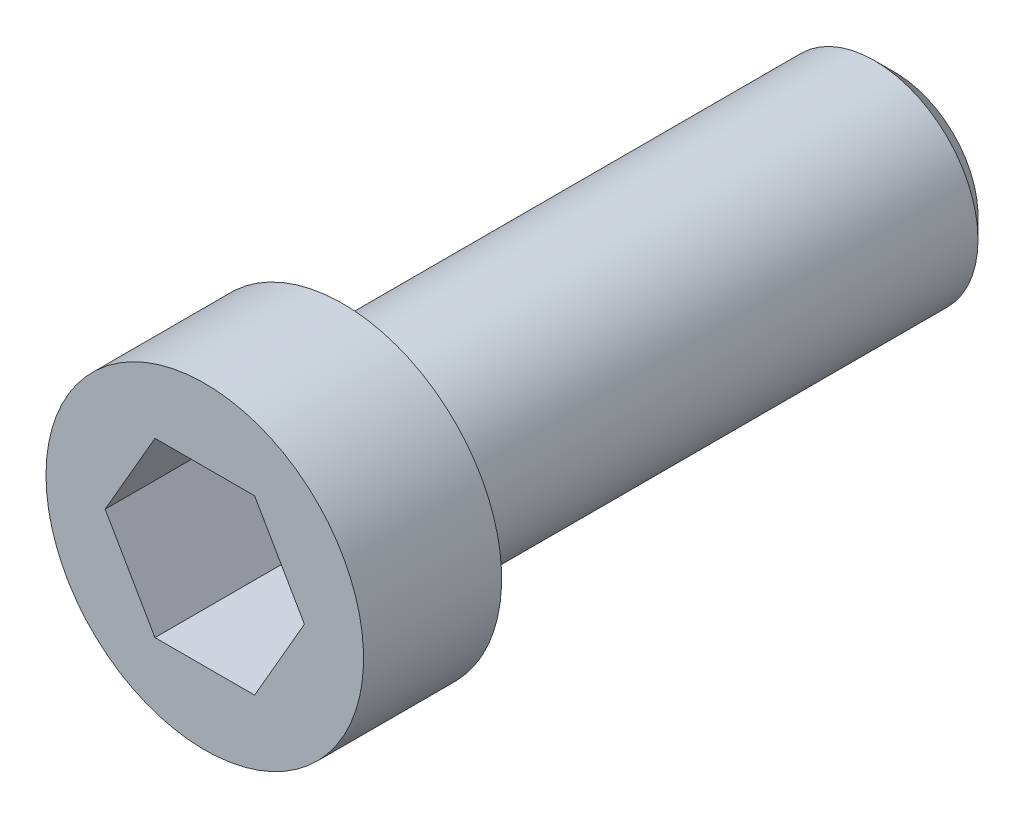
ISO-10303-21;
HEADER;
FILE_DESCRIPTION(('STEP AP214'),'2;1');
FILE_NAME('part.step','',(''),(''),'','','');
FILE_SCHEMA(('AUTOMOTIVE_DESIGN { 1 0 10303 214 1 1 1 1 }'));
ENDSEC;
DATA;
#1=APPLICATION_CONTEXT('core data for automotive mechanical design processes');
#2=APPLICATION_PROTOCOL_DEFINITION('international standard','automotive_design',2000,#1);
#3=PRODUCT_CONTEXT('',#1,'mechanical');
#4=PRODUCT('Part','Part','',(#3));
#5=PRODUCT_RELATED_PRODUCT_CATEGORY('part','',(#4));
#6=PRODUCT_DEFINITION_FORMATION('','',#4);
#7=PRODUCT_DEFINITION_CONTEXT('part definition',#1,'design');
#8=PRODUCT_DEFINITION('design','',#6,#7);
#9=PRODUCT_DEFINITION_SHAPE('','',#8);
#10=(LENGTH_UNIT() NAMED_UNIT(*) SI_UNIT(.MILLI.,.METRE.));
#11=(NAMED_UNIT(*) PLANE_ANGLE_UNIT() SI_UNIT($,.RADIAN.));
#12=(NAMED_UNIT(*) SI_UNIT($,.STERADIAN.) SOLID_ANGLE_UNIT());
#13=UNCERTAINTY_MEASURE_WITH_UNIT(LENGTH_MEASURE(1.E-05),#10,'distance_accuracy_value','');
#14=(GEOMETRIC_REPRESENTATION_CONTEXT(3) GLOBAL_UNCERTAINTY_ASSIGNED_CONTEXT((#13)) GLOBAL_UNIT_ASSIGNED_CONTEXT((#10,
#11,#12)) REPRESENTATION_CONTEXT('',''));
#15=CARTESIAN_POINT('',(0.,0.,0.));
#16=DIRECTION('',(0.,0.,1.));
#17=DIRECTION('',(1.,0.,0.));
#18=AXIS2_PLACEMENT_3D('',#15,#16,#17);
#19=CARTESIAN_POINT('',(0.,0.,0.));
#20=DIRECTION('',(0.,0.,1.));
#21=DIRECTION('',(1.,0.,0.));
#22=AXIS2_PLACEMENT_3D('',#19,#20,#21);
#23=PLANE('',#22);
#24=DIRECTION('',(0.5,0.866025403784439,0.));
#25=VECTOR('',#24,1.);
#26=CARTESIAN_POINT('',(0.721687836487033,-1.25,0.));
#27=LINE('',#26,#25);
#28=CARTESIAN_POINT('',(0.721687836487033,-1.25,0.));
#29=VERTEX_POINT('',#28);
#30=CARTESIAN_POINT('',(1.44337567297407,0.,0.));
#31=VERTEX_POINT('',#30);
#32=EDGE_CURVE('E49',#29,#31,#27,.T.);
#33=ORIENTED_EDGE('',*,*,#32,.F.);
#34=DIRECTION('',(1.,0.,0.));
#35=VECTOR('',#34,1.);
#36=CARTESIAN_POINT('',(-0.721687836487032,-1.25,0.));
#37=LINE('',#36,#35);
#38=CARTESIAN_POINT('',(-0.721687836487032,-1.25,0.));
#39=VERTEX_POINT('',#38);
#40=EDGE_CURVE('E132',#39,#29,#37,.T.);
#41=ORIENTED_EDGE('',*,*,#40,.F.);
#42=DIRECTION('',(0.5,-0.866025403784439,0.));
#43=VECTOR('',#42,1.);
#44=CARTESIAN_POINT('',(-1.44337567297406,0.,0.));
#45=LINE('',#44,#43);
#46=CARTESIAN_POINT('',(-1.44337567297406,0.,0.));
#47=VERTEX_POINT('',#46);
#48=EDGE_CURVE('E130',#47,#39,#45,.T.);
#49=ORIENTED_EDGE('',*,*,#48,.F.);
#50=DIRECTION('',(-0.5,-0.866025403784439,0.));
#51=VECTOR('',#50,1.);
#52=CARTESIAN_POINT('',(-0.721687836487032,1.25,0.));
#53=LINE('',#52,#51);
#54=CARTESIAN_POINT('',(-0.721687836487032,1.25,0.));
#55=VERTEX_POINT('',#54);
#56=EDGE_CURVE('E97',#55,#47,#53,.T.);
#57=ORIENTED_EDGE('',*,*,#56,.F.);
#58=DIRECTION('',(-1.,0.,0.));
#59=VECTOR('',#58,1.);
#60=CARTESIAN_POINT('',(0.721687836487032,1.25,0.));
#61=LINE('',#60,#59);
#62=CARTESIAN_POINT('',(0.721687836487032,1.25,0.));
#63=VERTEX_POINT('',#62);
#64=EDGE_CURVE('E126',#63,#55,#61,.T.);
#65=ORIENTED_EDGE('',*,*,#64,.F.);
#66=DIRECTION('',(-0.5,0.866025403784438,0.));
#67=VECTOR('',#66,1.);
#68=CARTESIAN_POINT('',(1.44337567297407,0.,0.));
#69=LINE('',#68,#67);
#70=EDGE_CURVE('E123',#31,#63,#69,.T.);
#71=ORIENTED_EDGE('',*,*,#70,.F.);
#72=EDGE_LOOP('',(#33,#41,#49,#57,#65,#71));
#73=FACE_BOUND('',#72,.T.);
#74=CARTESIAN_POINT('',(0.,0.,0.));
#75=DIRECTION('',(0.,0.,-1.));
#76=DIRECTION('',(-1.,0.,0.));
#77=AXIS2_PLACEMENT_3D('',#74,#75,#76);
#78=CIRCLE('',#77,2.3);
#79=CARTESIAN_POINT('',(-2.3,0.,0.));
#80=VERTEX_POINT('',#79);
#81=EDGE_CURVE('E144',#80,#80,#78,.T.);
#82=ORIENTED_EDGE('',*,*,#81,.F.);
#83=EDGE_LOOP('',(#82));
#84=FACE_BOUND('',#83,.T.);
#85=ADVANCED_FACE('F34',(#73,#84),#23,.T.);
#86=CARTESIAN_POINT('',(0.,0.,0.));
#87=DIRECTION('',(0.,0.,-1.));
#88=DIRECTION('',(-1.,0.,0.));
#89=AXIS2_PLACEMENT_3D('',#86,#87,#88);
#90=CYLINDRICAL_SURFACE('',#89,2.3);
#91=ORIENTED_EDGE('',*,*,#81,.T.);
#92=EDGE_LOOP('',(#91));
#93=FACE_BOUND('',#92,.T.);
#94=CARTESIAN_POINT('',(0.,0.,-2.));
#95=DIRECTION('',(0.,0.,-1.));
#96=DIRECTION('',(-1.,0.,0.));
#97=AXIS2_PLACEMENT_3D('',#94,#95,#96);
#98=CIRCLE('',#97,2.3);
#99=CARTESIAN_POINT('',(-2.3,0.,-2.));
#100=VERTEX_POINT('',#99);
#101=EDGE_CURVE('E136',#100,#100,#98,.T.);
#102=ORIENTED_EDGE('',*,*,#101,.F.);
#103=EDGE_LOOP('',(#102));
#104=FACE_BOUND('',#103,.T.);
#105=ADVANCED_FACE('F166',(#93,#104),#90,.T.);
#106=CARTESIAN_POINT('',(0.,2.3,-2.));
#107=DIRECTION('',(0.,0.,-1.));
#108=DIRECTION('',(-1.,0.,0.));
#109=AXIS2_PLACEMENT_3D('',#106,#107,#108);
#110=PLANE('',#109);
#111=CARTESIAN_POINT('',(0.,0.,-2.));
#112=DIRECTION('',(0.,0.,-1.));
#113=DIRECTION('',(-1.,0.,0.));
#114=AXIS2_PLACEMENT_3D('',#111,#112,#113);
#115=CIRCLE('',#114,1.8);
#116=CARTESIAN_POINT('',(-1.8,0.,-2.));
#117=VERTEX_POINT('',#116);
#118=EDGE_CURVE('E150',#117,#117,#115,.F.);
#119=ORIENTED_EDGE('',*,*,#118,.T.);
#120=EDGE_LOOP('',(#119));
#121=FACE_BOUND('',#120,.T.);
#122=ORIENTED_EDGE('',*,*,#101,.T.);
#123=EDGE_LOOP('',(#122));
#124=FACE_BOUND('',#123,.T.);
#125=ADVANCED_FACE('F172',(#121,#124),#110,.T.);
#126=CARTESIAN_POINT('',(0.,0.,0.));
#127=DIRECTION('',(0.,0.,-1.));
#128=DIRECTION('',(-1.,0.,0.));
#129=AXIS2_PLACEMENT_3D('',#126,#127,#128);
#130=CYLINDRICAL_SURFACE('',#129,1.5);
#131=CARTESIAN_POINT('',(0.,0.,-9.7));
#132=DIRECTION('',(0.,0.,-1.));
#133=DIRECTION('',(-1.,0.,0.));
#134=AXIS2_PLACEMENT_3D('',#131,#132,#133);
#135=CIRCLE('',#134,1.5);
#136=CARTESIAN_POINT('',(-1.5,0.,-9.7));
#137=VERTEX_POINT('',#136);
#138=EDGE_CURVE('E11',#137,#137,#135,.F.);
#139=ORIENTED_EDGE('',*,*,#138,.T.);
#140=EDGE_LOOP('',(#139));
#141=FACE_BOUND('',#140,.T.);
#142=CARTESIAN_POINT('',(0.,0.,-2.3));
#143=DIRECTION('',(0.,0.,-1.));
#144=DIRECTION('',(-1.,0.,0.));
#145=AXIS2_PLACEMENT_3D('',#142,#143,#144);
#146=CIRCLE('',#145,1.5);
#147=CARTESIAN_POINT('',(-1.5,0.,-2.3));
#148=VERTEX_POINT('',#147);
#149=EDGE_CURVE('E147',#148,#148,#146,.T.);
#150=ORIENTED_EDGE('',*,*,#149,.T.);
#151=EDGE_LOOP('',(#150));
#152=FACE_BOUND('',#151,.T.);
#153=ADVANCED_FACE('F179',(#141,#152),#130,.T.);
#154=CARTESIAN_POINT('',(0.,1.5,-10.));
#155=DIRECTION('',(0.,0.,-1.));
#156=DIRECTION('',(-1.,0.,0.));
#157=AXIS2_PLACEMENT_3D('',#154,#155,#156);
#158=PLANE('',#157);
#159=CARTESIAN_POINT('',(0.,0.,-10.));
#160=DIRECTION('',(0.,0.,-1.));
#161=DIRECTION('',(-1.,0.,0.));
#162=AXIS2_PLACEMENT_3D('',#159,#160,#161);
#163=CIRCLE('',#162,1.2);
#164=CARTESIAN_POINT('',(-1.2,0.,-10.));
#165=VERTEX_POINT('',#164);
#166=EDGE_CURVE('E42',#165,#165,#163,.T.);
#167=ORIENTED_EDGE('',*,*,#166,.T.);
#168=EDGE_LOOP('',(#167));
#169=FACE_BOUND('',#168,.T.);
#170=ADVANCED_FACE('F155',(#169),#158,.T.);
#171=CARTESIAN_POINT('',(0.721687836487033,-1.25,-2.));
#172=DIRECTION('',(0.866025403784439,-0.5,0.));
#173=DIRECTION('',(0.5,0.866025403784439,0.));
#174=AXIS2_PLACEMENT_3D('',#171,#172,#173);
#175=PLANE('',#174);
#176=ORIENTED_EDGE('',*,*,#32,.T.);
#177=DIRECTION('',(0.,0.,1.));
#178=VECTOR('',#177,1.);
#179=CARTESIAN_POINT('',(1.44337567297407,0.,-2.));
#180=LINE('',#179,#178);
#181=CARTESIAN_POINT('',(1.44337567297407,0.,-2.));
#182=VERTEX_POINT('',#181);
#183=EDGE_CURVE('E79',#182,#31,#180,.T.);
#184=ORIENTED_EDGE('',*,*,#183,.F.);
#185=DIRECTION('',(0.5,0.866025403784439,0.));
#186=VECTOR('',#185,1.);
#187=CARTESIAN_POINT('',(0.721687836487033,-1.25,-2.));
#188=LINE('',#187,#186);
#189=CARTESIAN_POINT('',(0.721687836487033,-1.25,-2.));
#190=VERTEX_POINT('',#189);
#191=EDGE_CURVE('E134',#190,#182,#188,.T.);
#192=ORIENTED_EDGE('',*,*,#191,.F.);
#193=DIRECTION('',(0.,0.,1.));
#194=VECTOR('',#193,1.);
#195=CARTESIAN_POINT('',(0.721687836487033,-1.25,-2.));
#196=LINE('',#195,#194);
#197=EDGE_CURVE('E57',#190,#29,#196,.T.);
#198=ORIENTED_EDGE('',*,*,#197,.T.);
#199=EDGE_LOOP('',(#176,#184,#192,#198));
#200=FACE_BOUND('',#199,.T.);
#201=ADVANCED_FACE('F186',(#200),#175,.F.);
#202=CARTESIAN_POINT('',(-0.721687836487032,-1.25,-2.));
#203=DIRECTION('',(0.,-1.,0.));
#204=DIRECTION('',(0.,0.,-1.));
#205=AXIS2_PLACEMENT_3D('',#202,#203,#204);
#206=PLANE('',#205);
#207=ORIENTED_EDGE('',*,*,#40,.T.);
#208=ORIENTED_EDGE('',*,*,#197,.F.);
#209=DIRECTION('',(1.,0.,0.));
#210=VECTOR('',#209,1.);
#211=CARTESIAN_POINT('',(-0.721687836487032,-1.25,-2.));
#212=LINE('',#211,#210);
#213=CARTESIAN_POINT('',(-0.721687836487032,-1.25,-2.));
#214=VERTEX_POINT('',#213);
#215=EDGE_CURVE('E109',#214,#190,#212,.T.);
#216=ORIENTED_EDGE('',*,*,#215,.F.);
#217=DIRECTION('',(0.,0.,1.));
#218=VECTOR('',#217,1.);
#219=CARTESIAN_POINT('',(-0.721687836487032,-1.25,-2.));
#220=LINE('',#219,#218);
#221=EDGE_CURVE('E101',#214,#39,#220,.T.);
#222=ORIENTED_EDGE('',*,*,#221,.T.);
#223=EDGE_LOOP('',(#207,#208,#216,#222));
#224=FACE_BOUND('',#223,.T.);
#225=ADVANCED_FACE('F189',(#224),#206,.F.);
#226=CARTESIAN_POINT('',(-1.44337567297406,0.,-2.));
#227=DIRECTION('',(-0.866025403784439,-0.5,0.));
#228=DIRECTION('',(0.5,-0.866025403784439,0.));
#229=AXIS2_PLACEMENT_3D('',#226,#227,#228);
#230=PLANE('',#229);
#231=ORIENTED_EDGE('',*,*,#48,.T.);
#232=ORIENTED_EDGE('',*,*,#221,.F.);
#233=DIRECTION('',(0.5,-0.866025403784439,0.));
#234=VECTOR('',#233,1.);
#235=CARTESIAN_POINT('',(-1.44337567297406,0.,-2.));
#236=LINE('',#235,#234);
#237=CARTESIAN_POINT('',(-1.44337567297406,0.,-2.));
#238=VERTEX_POINT('',#237);
#239=EDGE_CURVE('E105',#238,#214,#236,.T.);
#240=ORIENTED_EDGE('',*,*,#239,.F.);
#241=DIRECTION('',(0.,0.,1.));
#242=VECTOR('',#241,1.);
#243=CARTESIAN_POINT('',(-1.44337567297406,0.,-2.));
#244=LINE('',#243,#242);
#245=EDGE_CURVE('E90',#238,#47,#244,.T.);
#246=ORIENTED_EDGE('',*,*,#245,.T.);
#247=EDGE_LOOP('',(#231,#232,#240,#246));
#248=FACE_BOUND('',#247,.T.);
#249=ADVANCED_FACE('F106',(#248),#230,.F.);
#250=CARTESIAN_POINT('',(-0.721687836487032,1.25,-2.));
#251=DIRECTION('',(-0.866025403784439,0.5,0.));
#252=DIRECTION('',(-0.5,-0.866025403784439,0.));
#253=AXIS2_PLACEMENT_3D('',#250,#251,#252);
#254=PLANE('',#253);
#255=ORIENTED_EDGE('',*,*,#56,.T.);
#256=ORIENTED_EDGE('',*,*,#245,.F.);
#257=DIRECTION('',(-0.5,-0.866025403784439,0.));
#258=VECTOR('',#257,1.);
#259=CARTESIAN_POINT('',(-0.721687836487032,1.25,-2.));
#260=LINE('',#259,#258);
#261=CARTESIAN_POINT('',(-0.721687836487032,1.25,-2.));
#262=VERTEX_POINT('',#261);
#263=EDGE_CURVE('E94',#262,#238,#260,.T.);
#264=ORIENTED_EDGE('',*,*,#263,.F.);
#265=DIRECTION('',(0.,0.,1.));
#266=VECTOR('',#265,1.);
#267=CARTESIAN_POINT('',(-0.721687836487032,1.25,-2.));
#268=LINE('',#267,#266);
#269=EDGE_CURVE('E102',#262,#55,#268,.T.);
#270=ORIENTED_EDGE('',*,*,#269,.T.);
#271=EDGE_LOOP('',(#255,#256,#264,#270));
#272=FACE_BOUND('',#271,.T.);
#273=ADVANCED_FACE('F92',(#272),#254,.F.);
#274=CARTESIAN_POINT('',(0.721687836487032,1.25,-2.));
#275=DIRECTION('',(0.,1.,0.));
#276=DIRECTION('',(0.,0.,1.));
#277=AXIS2_PLACEMENT_3D('',#274,#275,#276);
#278=PLANE('',#277);
#279=ORIENTED_EDGE('',*,*,#64,.T.);
#280=ORIENTED_EDGE('',*,*,#269,.F.);
#281=DIRECTION('',(-1.,0.,0.));
#282=VECTOR('',#281,1.);
#283=CARTESIAN_POINT('',(0.721687836487032,1.25,-2.));
#284=LINE('',#283,#282);
#285=CARTESIAN_POINT('',(0.721687836487032,1.25,-2.));
#286=VERTEX_POINT('',#285);
#287=EDGE_CURVE('E115',#286,#262,#284,.T.);
#288=ORIENTED_EDGE('',*,*,#287,.F.);
#289=DIRECTION('',(0.,0.,1.));
#290=VECTOR('',#289,1.);
#291=CARTESIAN_POINT('',(0.721687836487032,1.25,-2.));
#292=LINE('',#291,#290);
#293=EDGE_CURVE('E139',#286,#63,#292,.T.);
#294=ORIENTED_EDGE('',*,*,#293,.T.);
#295=EDGE_LOOP('',(#279,#280,#288,#294));
#296=FACE_BOUND('',#295,.T.);
#297=ADVANCED_FACE('F193',(#296),#278,.F.);
#298=CARTESIAN_POINT('',(1.44337567297407,0.,-2.));
#299=DIRECTION('',(0.866025403784438,0.5,0.));
#300=DIRECTION('',(-0.5,0.866025403784438,0.));
#301=AXIS2_PLACEMENT_3D('',#298,#299,#300);
#302=PLANE('',#301);
#303=ORIENTED_EDGE('',*,*,#70,.T.);
#304=ORIENTED_EDGE('',*,*,#293,.F.);
#305=DIRECTION('',(-0.5,0.866025403784438,0.));
#306=VECTOR('',#305,1.);
#307=CARTESIAN_POINT('',(1.44337567297407,0.,-2.));
#308=LINE('',#307,#306);
#309=EDGE_CURVE('E117',#182,#286,#308,.T.);
#310=ORIENTED_EDGE('',*,*,#309,.F.);
#311=ORIENTED_EDGE('',*,*,#183,.T.);
#312=EDGE_LOOP('',(#303,#304,#310,#311));
#313=FACE_BOUND('',#312,.T.);
#314=ADVANCED_FACE('F190',(#313),#302,.F.);
#315=CARTESIAN_POINT('',(0.,0.,-2.));
#316=DIRECTION('',(0.,0.,1.));
#317=DIRECTION('',(1.,0.,0.));
#318=AXIS2_PLACEMENT_3D('',#315,#316,#317);
#319=PLANE('',#318);
#320=ORIENTED_EDGE('',*,*,#191,.T.);
#321=ORIENTED_EDGE('',*,*,#309,.T.);
#322=ORIENTED_EDGE('',*,*,#287,.T.);
#323=ORIENTED_EDGE('',*,*,#263,.T.);
#324=ORIENTED_EDGE('',*,*,#239,.T.);
#325=ORIENTED_EDGE('',*,*,#215,.T.);
#326=EDGE_LOOP('',(#320,#321,#322,#323,#324,#325));
#327=FACE_BOUND('',#326,.T.);
#328=ADVANCED_FACE('F112',(#327),#319,.T.);
#329=CARTESIAN_POINT('',(0.,0.,-2.3));
#330=DIRECTION('',(0.,0.,-1.));
#331=DIRECTION('',(-1.,0.,0.));
#332=AXIS2_PLACEMENT_3D('',#329,#330,#331);
#333=TOROIDAL_SURFACE('',#332,1.8,0.3);
#334=ORIENTED_EDGE('',*,*,#118,.F.);
#335=EDGE_LOOP('',(#334));
#336=FACE_BOUND('',#335,.T.);
#337=ORIENTED_EDGE('',*,*,#149,.F.);
#338=EDGE_LOOP('',(#337));
#339=FACE_BOUND('',#338,.T.);
#340=ADVANCED_FACE('F158',(#336,#339),#333,.F.);
#341=CARTESIAN_POINT('',(0.,0.,-10.));
#342=DIRECTION('',(0.,0.,1.));
#343=DIRECTION('',(1.,0.,0.));
#344=AXIS2_PLACEMENT_3D('',#341,#342,#343);
#345=CONICAL_SURFACE('',#344,1.2,0.785398163397447);
#346=ORIENTED_EDGE('',*,*,#138,.F.);
#347=EDGE_LOOP('',(#346));
#348=FACE_BOUND('',#347,.T.);
#349=ORIENTED_EDGE('',*,*,#166,.F.);
#350=EDGE_LOOP('',(#349));
#351=FACE_BOUND('',#350,.T.);
#352=ADVANCED_FACE('F36',(#348,#351),#345,.T.);
#353=CLOSED_SHELL('',(#85,#105,#125,#153,#170,#201,#225,#249,#273,#297,#314,#328,#340,#352));
#354=MANIFOLD_SOLID_BREP('B2',#353);
#355=ADVANCED_BREP_SHAPE_REPRESENTATION('',(#18,#354),#14);
#356=SHAPE_DEFINITION_REPRESENTATION(#9,#355);
ENDSEC;
END-ISO-10303-21;
